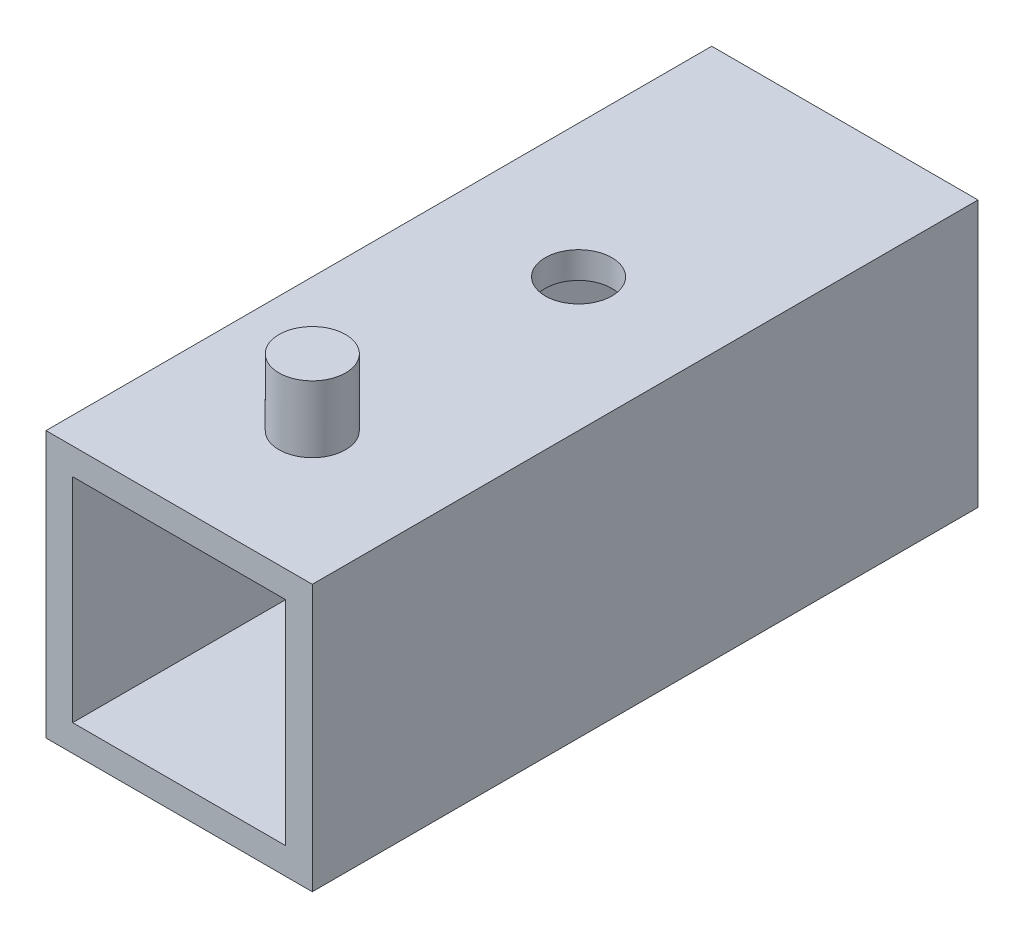
ISO-10303-21;
HEADER;
FILE_DESCRIPTION(('STEP AP214'),'2;1');
FILE_NAME('part.step','',(''),(''),'','','');
FILE_SCHEMA(('AUTOMOTIVE_DESIGN { 1 0 10303 214 1 1 1 1 }'));
ENDSEC;
DATA;
#1=APPLICATION_CONTEXT('core data for automotive mechanical design processes');
#2=APPLICATION_PROTOCOL_DEFINITION('international standard','automotive_design',2000,#1);
#3=PRODUCT_CONTEXT('',#1,'mechanical');
#4=PRODUCT('Part','Part','',(#3));
#5=PRODUCT_RELATED_PRODUCT_CATEGORY('part','',(#4));
#6=PRODUCT_DEFINITION_FORMATION('','',#4);
#7=PRODUCT_DEFINITION_CONTEXT('part definition',#1,'design');
#8=PRODUCT_DEFINITION('design','',#6,#7);
#9=PRODUCT_DEFINITION_SHAPE('','',#8);
#10=(LENGTH_UNIT() NAMED_UNIT(*) SI_UNIT(.MILLI.,.METRE.));
#11=(NAMED_UNIT(*) PLANE_ANGLE_UNIT() SI_UNIT($,.RADIAN.));
#12=(NAMED_UNIT(*) SI_UNIT($,.STERADIAN.) SOLID_ANGLE_UNIT());
#13=UNCERTAINTY_MEASURE_WITH_UNIT(LENGTH_MEASURE(1.E-05),#10,'distance_accuracy_value','');
#14=(GEOMETRIC_REPRESENTATION_CONTEXT(3) GLOBAL_UNCERTAINTY_ASSIGNED_CONTEXT((#13)) GLOBAL_UNIT_ASSIGNED_CONTEXT((#10,
#11,#12)) REPRESENTATION_CONTEXT('',''));
#15=CARTESIAN_POINT('',(0.,0.,0.));
#16=DIRECTION('',(0.,0.,1.));
#17=DIRECTION('',(1.,0.,0.));
#18=AXIS2_PLACEMENT_3D('',#15,#16,#17);
#19=CARTESIAN_POINT('',(0.,0.,31.75));
#20=DIRECTION('',(0.,0.,1.));
#21=DIRECTION('',(1.,0.,0.));
#22=AXIS2_PLACEMENT_3D('',#19,#20,#21);
#23=PLANE('',#22);
#24=DIRECTION('',(0.,1.,0.));
#25=VECTOR('',#24,1.);
#26=CARTESIAN_POINT('',(12.7,-12.7,31.75));
#27=LINE('',#26,#25);
#28=CARTESIAN_POINT('',(12.7,-12.7,31.75));
#29=VERTEX_POINT('',#28);
#30=CARTESIAN_POINT('',(12.7,12.7,31.75));
#31=VERTEX_POINT('',#30);
#32=EDGE_CURVE('E160',#29,#31,#27,.T.);
#33=ORIENTED_EDGE('',*,*,#32,.T.);
#34=DIRECTION('',(-1.,0.,0.));
#35=VECTOR('',#34,1.);
#36=CARTESIAN_POINT('',(-12.7,12.7,31.75));
#37=LINE('',#36,#35);
#38=CARTESIAN_POINT('',(-12.7,12.7,31.75));
#39=VERTEX_POINT('',#38);
#40=EDGE_CURVE('E163',#31,#39,#37,.T.);
#41=ORIENTED_EDGE('',*,*,#40,.T.);
#42=DIRECTION('',(0.,-1.,0.));
#43=VECTOR('',#42,1.);
#44=CARTESIAN_POINT('',(-12.7,-12.7,31.75));
#45=LINE('',#44,#43);
#46=CARTESIAN_POINT('',(-12.7,-12.7,31.75));
#47=VERTEX_POINT('',#46);
#48=EDGE_CURVE('E166',#39,#47,#45,.T.);
#49=ORIENTED_EDGE('',*,*,#48,.T.);
#50=DIRECTION('',(1.,0.,0.));
#51=VECTOR('',#50,1.);
#52=CARTESIAN_POINT('',(-12.7,-12.7,31.75));
#53=LINE('',#52,#51);
#54=EDGE_CURVE('E168',#47,#29,#53,.T.);
#55=ORIENTED_EDGE('',*,*,#54,.T.);
#56=EDGE_LOOP('',(#33,#41,#49,#55));
#57=FACE_BOUND('',#56,.T.);
#58=DIRECTION('',(-1.,0.,0.));
#59=VECTOR('',#58,1.);
#60=CARTESIAN_POINT('',(0.,10.16,31.75));
#61=LINE('',#60,#59);
#62=CARTESIAN_POINT('',(10.16,10.16,31.75));
#63=VERTEX_POINT('',#62);
#64=CARTESIAN_POINT('',(-10.16,10.16,31.75));
#65=VERTEX_POINT('',#64);
#66=EDGE_CURVE('E130',#63,#65,#61,.T.);
#67=ORIENTED_EDGE('',*,*,#66,.F.);
#68=DIRECTION('',(0.,1.,0.));
#69=VECTOR('',#68,1.);
#70=CARTESIAN_POINT('',(10.16,0.,31.75));
#71=LINE('',#70,#69);
#72=CARTESIAN_POINT('',(10.16,-10.16,31.75));
#73=VERTEX_POINT('',#72);
#74=EDGE_CURVE('E122',#73,#63,#71,.T.);
#75=ORIENTED_EDGE('',*,*,#74,.F.);
#76=DIRECTION('',(1.,0.,0.));
#77=VECTOR('',#76,1.);
#78=CARTESIAN_POINT('',(0.,-10.16,31.75));
#79=LINE('',#78,#77);
#80=CARTESIAN_POINT('',(-10.16,-10.16,31.75));
#81=VERTEX_POINT('',#80);
#82=EDGE_CURVE('E144',#81,#73,#79,.T.);
#83=ORIENTED_EDGE('',*,*,#82,.F.);
#84=DIRECTION('',(0.,-1.,0.));
#85=VECTOR('',#84,1.);
#86=CARTESIAN_POINT('',(-10.16,0.,31.75));
#87=LINE('',#86,#85);
#88=EDGE_CURVE('E142',#65,#81,#87,.T.);
#89=ORIENTED_EDGE('',*,*,#88,.F.);
#90=EDGE_LOOP('',(#67,#75,#83,#89));
#91=FACE_BOUND('',#90,.T.);
#92=ADVANCED_FACE('F56',(#57,#91),#23,.T.);
#93=CARTESIAN_POINT('',(0.,0.,-31.75));
#94=DIRECTION('',(0.,0.,1.));
#95=DIRECTION('',(1.,0.,0.));
#96=AXIS2_PLACEMENT_3D('',#93,#94,#95);
#97=PLANE('',#96);
#98=DIRECTION('',(0.,1.,0.));
#99=VECTOR('',#98,1.);
#100=CARTESIAN_POINT('',(12.7,-12.7,-31.75));
#101=LINE('',#100,#99);
#102=CARTESIAN_POINT('',(12.7,-12.7,-31.75));
#103=VERTEX_POINT('',#102);
#104=CARTESIAN_POINT('',(12.7,12.7,-31.75));
#105=VERTEX_POINT('',#104);
#106=EDGE_CURVE('E138',#103,#105,#101,.T.);
#107=ORIENTED_EDGE('',*,*,#106,.F.);
#108=DIRECTION('',(1.,0.,0.));
#109=VECTOR('',#108,1.);
#110=CARTESIAN_POINT('',(-12.7,-12.7,-31.75));
#111=LINE('',#110,#109);
#112=CARTESIAN_POINT('',(-12.7,-12.7,-31.75));
#113=VERTEX_POINT('',#112);
#114=EDGE_CURVE('E164',#113,#103,#111,.T.);
#115=ORIENTED_EDGE('',*,*,#114,.F.);
#116=DIRECTION('',(0.,-1.,0.));
#117=VECTOR('',#116,1.);
#118=CARTESIAN_POINT('',(-12.7,-12.7,-31.75));
#119=LINE('',#118,#117);
#120=CARTESIAN_POINT('',(-12.7,12.7,-31.75));
#121=VERTEX_POINT('',#120);
#122=EDGE_CURVE('E175',#121,#113,#119,.T.);
#123=ORIENTED_EDGE('',*,*,#122,.F.);
#124=DIRECTION('',(-1.,0.,0.));
#125=VECTOR('',#124,1.);
#126=CARTESIAN_POINT('',(-12.7,12.7,-31.75));
#127=LINE('',#126,#125);
#128=EDGE_CURVE('E173',#105,#121,#127,.T.);
#129=ORIENTED_EDGE('',*,*,#128,.F.);
#130=EDGE_LOOP('',(#107,#115,#123,#129));
#131=FACE_BOUND('',#130,.T.);
#132=DIRECTION('',(0.,1.,0.));
#133=VECTOR('',#132,1.);
#134=CARTESIAN_POINT('',(10.16,0.,-31.75));
#135=LINE('',#134,#133);
#136=CARTESIAN_POINT('',(10.16,-10.16,-31.75));
#137=VERTEX_POINT('',#136);
#138=CARTESIAN_POINT('',(10.16,10.16,-31.75));
#139=VERTEX_POINT('',#138);
#140=EDGE_CURVE('E80',#137,#139,#135,.T.);
#141=ORIENTED_EDGE('',*,*,#140,.T.);
#142=DIRECTION('',(-1.,0.,0.));
#143=VECTOR('',#142,1.);
#144=CARTESIAN_POINT('',(0.,10.16,-31.75));
#145=LINE('',#144,#143);
#146=CARTESIAN_POINT('',(-10.16,10.16,-31.75));
#147=VERTEX_POINT('',#146);
#148=EDGE_CURVE('E137',#139,#147,#145,.T.);
#149=ORIENTED_EDGE('',*,*,#148,.T.);
#150=DIRECTION('',(0.,-1.,0.));
#151=VECTOR('',#150,1.);
#152=CARTESIAN_POINT('',(-10.16,0.,-31.75));
#153=LINE('',#152,#151);
#154=CARTESIAN_POINT('',(-10.16,-10.16,-31.75));
#155=VERTEX_POINT('',#154);
#156=EDGE_CURVE('E152',#147,#155,#153,.T.);
#157=ORIENTED_EDGE('',*,*,#156,.T.);
#158=DIRECTION('',(1.,0.,0.));
#159=VECTOR('',#158,1.);
#160=CARTESIAN_POINT('',(0.,-10.16,-31.75));
#161=LINE('',#160,#159);
#162=EDGE_CURVE('E131',#155,#137,#161,.T.);
#163=ORIENTED_EDGE('',*,*,#162,.T.);
#164=EDGE_LOOP('',(#141,#149,#157,#163));
#165=FACE_BOUND('',#164,.T.);
#166=ADVANCED_FACE('F197',(#131,#165),#97,.F.);
#167=CARTESIAN_POINT('',(12.7,-12.7,31.75));
#168=DIRECTION('',(-1.,0.,0.));
#169=DIRECTION('',(0.,0.,1.));
#170=AXIS2_PLACEMENT_3D('',#167,#168,#169);
#171=PLANE('',#170);
#172=ORIENTED_EDGE('',*,*,#106,.T.);
#173=DIRECTION('',(0.,0.,-1.));
#174=VECTOR('',#173,1.);
#175=CARTESIAN_POINT('',(12.7,12.7,31.75));
#176=LINE('',#175,#174);
#177=EDGE_CURVE('E65',#31,#105,#176,.T.);
#178=ORIENTED_EDGE('',*,*,#177,.F.);
#179=ORIENTED_EDGE('',*,*,#32,.F.);
#180=DIRECTION('',(0.,0.,-1.));
#181=VECTOR('',#180,1.);
#182=CARTESIAN_POINT('',(12.7,-12.7,31.75));
#183=LINE('',#182,#181);
#184=EDGE_CURVE('E170',#29,#103,#183,.T.);
#185=ORIENTED_EDGE('',*,*,#184,.T.);
#186=EDGE_LOOP('',(#172,#178,#179,#185));
#187=FACE_BOUND('',#186,.T.);
#188=ADVANCED_FACE('F58',(#187),#171,.F.);
#189=CARTESIAN_POINT('',(-12.7,12.7,31.75));
#190=DIRECTION('',(0.,-1.,0.));
#191=DIRECTION('',(0.,0.,-1.));
#192=AXIS2_PLACEMENT_3D('',#189,#190,#191);
#193=PLANE('',#192);
#194=CARTESIAN_POINT('',(0.,12.7,-6.35));
#195=DIRECTION('',(0.,1.,0.));
#196=DIRECTION('',(0.,0.,1.));
#197=AXIS2_PLACEMENT_3D('',#194,#195,#196);
#198=CIRCLE('',#197,3.175);
#199=CARTESIAN_POINT('',(0.,12.7,-3.175));
#200=VERTEX_POINT('',#199);
#201=EDGE_CURVE('E229',#200,#200,#198,.T.);
#202=ORIENTED_EDGE('',*,*,#201,.F.);
#203=EDGE_LOOP('',(#202));
#204=FACE_BOUND('',#203,.T.);
#205=CARTESIAN_POINT('',(0.,12.7,19.05));
#206=DIRECTION('',(0.,-1.,0.));
#207=DIRECTION('',(0.,0.,-1.));
#208=AXIS2_PLACEMENT_3D('',#205,#206,#207);
#209=CIRCLE('',#208,3.175);
#210=CARTESIAN_POINT('',(0.,12.7,15.875));
#211=VERTEX_POINT('',#210);
#212=EDGE_CURVE('E12',#211,#211,#209,.F.);
#213=ORIENTED_EDGE('',*,*,#212,.F.);
#214=EDGE_LOOP('',(#213));
#215=FACE_BOUND('',#214,.T.);
#216=ORIENTED_EDGE('',*,*,#128,.T.);
#217=DIRECTION('',(0.,0.,-1.));
#218=VECTOR('',#217,1.);
#219=CARTESIAN_POINT('',(-12.7,12.7,31.75));
#220=LINE('',#219,#218);
#221=EDGE_CURVE('E183',#39,#121,#220,.T.);
#222=ORIENTED_EDGE('',*,*,#221,.F.);
#223=ORIENTED_EDGE('',*,*,#40,.F.);
#224=ORIENTED_EDGE('',*,*,#177,.T.);
#225=EDGE_LOOP('',(#216,#222,#223,#224));
#226=FACE_BOUND('',#225,.T.);
#227=ADVANCED_FACE('F189',(#204,#215,#226),#193,.F.);
#228=CARTESIAN_POINT('',(-12.7,-12.7,31.75));
#229=DIRECTION('',(1.,0.,0.));
#230=DIRECTION('',(0.,0.,-1.));
#231=AXIS2_PLACEMENT_3D('',#228,#229,#230);
#232=PLANE('',#231);
#233=ORIENTED_EDGE('',*,*,#122,.T.);
#234=DIRECTION('',(0.,0.,-1.));
#235=VECTOR('',#234,1.);
#236=CARTESIAN_POINT('',(-12.7,-12.7,31.75));
#237=LINE('',#236,#235);
#238=EDGE_CURVE('E180',#47,#113,#237,.T.);
#239=ORIENTED_EDGE('',*,*,#238,.F.);
#240=ORIENTED_EDGE('',*,*,#48,.F.);
#241=ORIENTED_EDGE('',*,*,#221,.T.);
#242=EDGE_LOOP('',(#233,#239,#240,#241));
#243=FACE_BOUND('',#242,.T.);
#244=ADVANCED_FACE('F202',(#243),#232,.F.);
#245=CARTESIAN_POINT('',(-12.7,-12.7,31.75));
#246=DIRECTION('',(0.,1.,0.));
#247=DIRECTION('',(0.,0.,1.));
#248=AXIS2_PLACEMENT_3D('',#245,#246,#247);
#249=PLANE('',#248);
#250=CARTESIAN_POINT('',(0.,-12.7,-6.35));
#251=DIRECTION('',(0.,1.,0.));
#252=DIRECTION('',(0.,0.,1.));
#253=AXIS2_PLACEMENT_3D('',#250,#251,#252);
#254=CIRCLE('',#253,3.175);
#255=CARTESIAN_POINT('',(0.,-12.7,-3.175));
#256=VERTEX_POINT('',#255);
#257=EDGE_CURVE('E265',#256,#256,#254,.T.);
#258=ORIENTED_EDGE('',*,*,#257,.T.);
#259=EDGE_LOOP('',(#258));
#260=FACE_BOUND('',#259,.T.);
#261=ORIENTED_EDGE('',*,*,#114,.T.);
#262=ORIENTED_EDGE('',*,*,#184,.F.);
#263=ORIENTED_EDGE('',*,*,#54,.F.);
#264=ORIENTED_EDGE('',*,*,#238,.T.);
#265=EDGE_LOOP('',(#261,#262,#263,#264));
#266=FACE_BOUND('',#265,.T.);
#267=ADVANCED_FACE('F206',(#260,#266),#249,.F.);
#268=CARTESIAN_POINT('',(10.16,0.,31.75));
#269=DIRECTION('',(-1.,0.,0.));
#270=DIRECTION('',(0.,0.,1.));
#271=AXIS2_PLACEMENT_3D('',#268,#269,#270);
#272=PLANE('',#271);
#273=ORIENTED_EDGE('',*,*,#140,.F.);
#274=DIRECTION('',(0.,0.,-1.));
#275=VECTOR('',#274,1.);
#276=CARTESIAN_POINT('',(10.16,-10.16,31.75));
#277=LINE('',#276,#275);
#278=EDGE_CURVE('E126',#73,#137,#277,.T.);
#279=ORIENTED_EDGE('',*,*,#278,.F.);
#280=ORIENTED_EDGE('',*,*,#74,.T.);
#281=DIRECTION('',(0.,0.,-1.));
#282=VECTOR('',#281,1.);
#283=CARTESIAN_POINT('',(10.16,10.16,31.75));
#284=LINE('',#283,#282);
#285=EDGE_CURVE('E125',#63,#139,#284,.T.);
#286=ORIENTED_EDGE('',*,*,#285,.T.);
#287=EDGE_LOOP('',(#273,#279,#280,#286));
#288=FACE_BOUND('',#287,.T.);
#289=ADVANCED_FACE('F124',(#288),#272,.T.);
#290=CARTESIAN_POINT('',(0.,10.16,31.75));
#291=DIRECTION('',(0.,-1.,0.));
#292=DIRECTION('',(0.,0.,-1.));
#293=AXIS2_PLACEMENT_3D('',#290,#291,#292);
#294=PLANE('',#293);
#295=CARTESIAN_POINT('',(0.,10.16,-6.35));
#296=DIRECTION('',(0.,-1.,0.));
#297=DIRECTION('',(0.,0.,-1.));
#298=AXIS2_PLACEMENT_3D('',#295,#296,#297);
#299=CIRCLE('',#298,3.175);
#300=CARTESIAN_POINT('',(0.,10.16,-9.525));
#301=VERTEX_POINT('',#300);
#302=EDGE_CURVE('E260',#301,#301,#299,.T.);
#303=ORIENTED_EDGE('',*,*,#302,.F.);
#304=EDGE_LOOP('',(#303));
#305=FACE_BOUND('',#304,.T.);
#306=ORIENTED_EDGE('',*,*,#148,.F.);
#307=ORIENTED_EDGE('',*,*,#285,.F.);
#308=ORIENTED_EDGE('',*,*,#66,.T.);
#309=DIRECTION('',(0.,0.,-1.));
#310=VECTOR('',#309,1.);
#311=CARTESIAN_POINT('',(-10.16,10.16,31.75));
#312=LINE('',#311,#310);
#313=EDGE_CURVE('E139',#65,#147,#312,.T.);
#314=ORIENTED_EDGE('',*,*,#313,.T.);
#315=EDGE_LOOP('',(#306,#307,#308,#314));
#316=FACE_BOUND('',#315,.T.);
#317=ADVANCED_FACE('F134',(#305,#316),#294,.T.);
#318=CARTESIAN_POINT('',(-10.16,0.,31.75));
#319=DIRECTION('',(1.,0.,0.));
#320=DIRECTION('',(0.,0.,-1.));
#321=AXIS2_PLACEMENT_3D('',#318,#319,#320);
#322=PLANE('',#321);
#323=ORIENTED_EDGE('',*,*,#156,.F.);
#324=ORIENTED_EDGE('',*,*,#313,.F.);
#325=ORIENTED_EDGE('',*,*,#88,.T.);
#326=DIRECTION('',(0.,0.,-1.));
#327=VECTOR('',#326,1.);
#328=CARTESIAN_POINT('',(-10.16,-10.16,31.75));
#329=LINE('',#328,#327);
#330=EDGE_CURVE('E72',#81,#155,#329,.T.);
#331=ORIENTED_EDGE('',*,*,#330,.T.);
#332=EDGE_LOOP('',(#323,#324,#325,#331));
#333=FACE_BOUND('',#332,.T.);
#334=ADVANCED_FACE('F245',(#333),#322,.T.);
#335=CARTESIAN_POINT('',(0.,-10.16,31.75));
#336=DIRECTION('',(0.,1.,0.));
#337=DIRECTION('',(0.,0.,1.));
#338=AXIS2_PLACEMENT_3D('',#335,#336,#337);
#339=PLANE('',#338);
#340=CARTESIAN_POINT('',(0.,-10.16,-6.35));
#341=DIRECTION('',(0.,1.,0.));
#342=DIRECTION('',(0.,0.,1.));
#343=AXIS2_PLACEMENT_3D('',#340,#341,#342);
#344=CIRCLE('',#343,3.175);
#345=CARTESIAN_POINT('',(0.,-10.16,-3.175));
#346=VERTEX_POINT('',#345);
#347=EDGE_CURVE('E60',#346,#346,#344,.T.);
#348=ORIENTED_EDGE('',*,*,#347,.F.);
#349=EDGE_LOOP('',(#348));
#350=FACE_BOUND('',#349,.T.);
#351=ORIENTED_EDGE('',*,*,#162,.F.);
#352=ORIENTED_EDGE('',*,*,#330,.F.);
#353=ORIENTED_EDGE('',*,*,#82,.T.);
#354=ORIENTED_EDGE('',*,*,#278,.T.);
#355=EDGE_LOOP('',(#351,#352,#353,#354));
#356=FACE_BOUND('',#355,.T.);
#357=ADVANCED_FACE('F235',(#350,#356),#339,.T.);
#358=CARTESIAN_POINT('',(0.,19.05,19.05));
#359=DIRECTION('',(0.,-1.,0.));
#360=DIRECTION('',(0.,0.,-1.));
#361=AXIS2_PLACEMENT_3D('',#358,#359,#360);
#362=CYLINDRICAL_SURFACE('',#361,3.175);
#363=CARTESIAN_POINT('',(0.,19.05,19.05));
#364=DIRECTION('',(0.,1.,0.));
#365=DIRECTION('',(0.,0.,1.));
#366=AXIS2_PLACEMENT_3D('',#363,#364,#365);
#367=CIRCLE('',#366,3.175);
#368=CARTESIAN_POINT('',(0.,19.05,22.225));
#369=VERTEX_POINT('',#368);
#370=EDGE_CURVE('E150',#369,#369,#367,.T.);
#371=ORIENTED_EDGE('',*,*,#370,.F.);
#372=EDGE_LOOP('',(#371));
#373=FACE_BOUND('',#372,.T.);
#374=ORIENTED_EDGE('',*,*,#212,.T.);
#375=EDGE_LOOP('',(#374));
#376=FACE_BOUND('',#375,.T.);
#377=ADVANCED_FACE('F232',(#373,#376),#362,.T.);
#378=CARTESIAN_POINT('',(0.,19.05,19.05));
#379=DIRECTION('',(0.,1.,0.));
#380=DIRECTION('',(0.,0.,1.));
#381=AXIS2_PLACEMENT_3D('',#378,#379,#380);
#382=PLANE('',#381);
#383=ORIENTED_EDGE('',*,*,#370,.T.);
#384=EDGE_LOOP('',(#383));
#385=FACE_BOUND('',#384,.T.);
#386=ADVANCED_FACE('F234',(#385),#382,.T.);
#387=CARTESIAN_POINT('',(0.,-12.7,-6.35));
#388=DIRECTION('',(0.,1.,0.));
#389=DIRECTION('',(0.,0.,1.));
#390=AXIS2_PLACEMENT_3D('',#387,#388,#389);
#391=CYLINDRICAL_SURFACE('',#390,3.175);
#392=ORIENTED_EDGE('',*,*,#347,.T.);
#393=EDGE_LOOP('',(#392));
#394=FACE_BOUND('',#393,.T.);
#395=ORIENTED_EDGE('',*,*,#257,.F.);
#396=EDGE_LOOP('',(#395));
#397=FACE_BOUND('',#396,.T.);
#398=ADVANCED_FACE('F242',(#394,#397),#391,.F.);
#399=ORIENTED_EDGE('',*,*,#302,.T.);
#400=EDGE_LOOP('',(#399));
#401=FACE_BOUND('',#400,.T.);
#402=ORIENTED_EDGE('',*,*,#201,.T.);
#403=EDGE_LOOP('',(#402));
#404=FACE_BOUND('',#403,.T.);
#405=ADVANCED_FACE('F272',(#401,#404),#391,.F.);
#406=CLOSED_SHELL('',(#92,#166,#188,#227,#244,#267,#289,#317,#334,#357,#377,#386,#398,#405));
#407=MANIFOLD_SOLID_BREP('B2',#406);
#408=ADVANCED_BREP_SHAPE_REPRESENTATION('',(#18,#407),#14);
#409=SHAPE_DEFINITION_REPRESENTATION(#9,#408);
ENDSEC;
END-ISO-10303-21;
